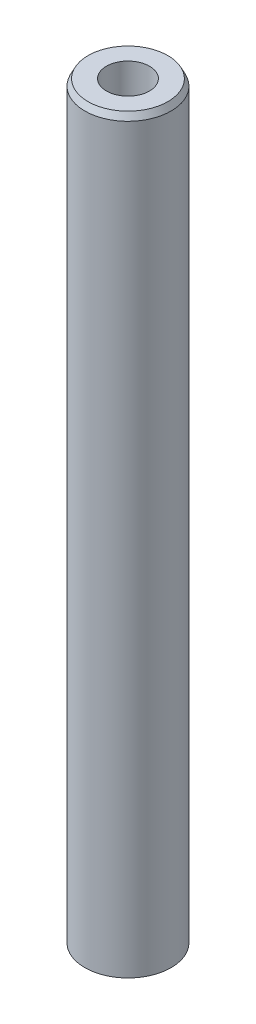
ISO-10303-21;
HEADER;
FILE_DESCRIPTION(('STEP AP214'),'2;1');
FILE_NAME('part.step','',(''),(''),'','','');
FILE_SCHEMA(('AUTOMOTIVE_DESIGN { 1 0 10303 214 1 1 1 1 }'));
ENDSEC;
DATA;
#1=APPLICATION_CONTEXT('core data for automotive mechanical design processes');
#2=APPLICATION_PROTOCOL_DEFINITION('international standard','automotive_design',2000,#1);
#3=PRODUCT_CONTEXT('',#1,'mechanical');
#4=PRODUCT('Part','Part','',(#3));
#5=PRODUCT_RELATED_PRODUCT_CATEGORY('part','',(#4));
#6=PRODUCT_DEFINITION_FORMATION('','',#4);
#7=PRODUCT_DEFINITION_CONTEXT('part definition',#1,'design');
#8=PRODUCT_DEFINITION('design','',#6,#7);
#9=PRODUCT_DEFINITION_SHAPE('','',#8);
#10=(LENGTH_UNIT() NAMED_UNIT(*) SI_UNIT(.MILLI.,.METRE.));
#11=(NAMED_UNIT(*) PLANE_ANGLE_UNIT() SI_UNIT($,.RADIAN.));
#12=(NAMED_UNIT(*) SI_UNIT($,.STERADIAN.) SOLID_ANGLE_UNIT());
#13=UNCERTAINTY_MEASURE_WITH_UNIT(LENGTH_MEASURE(1.E-05),#10,'distance_accuracy_value','');
#14=(GEOMETRIC_REPRESENTATION_CONTEXT(3) GLOBAL_UNCERTAINTY_ASSIGNED_CONTEXT((#13)) GLOBAL_UNIT_ASSIGNED_CONTEXT((#10,
#11,#12)) REPRESENTATION_CONTEXT('',''));
#15=CARTESIAN_POINT('',(0.,0.,0.));
#16=DIRECTION('',(0.,0.,1.));
#17=DIRECTION('',(1.,0.,0.));
#18=AXIS2_PLACEMENT_3D('',#15,#16,#17);
#19=CARTESIAN_POINT('',(0.,566.355812246667,0.));
#20=DIRECTION('',(0.,-1.,0.));
#21=DIRECTION('',(0.,0.,-1.));
#22=AXIS2_PLACEMENT_3D('',#19,#20,#21);
#23=CYLINDRICAL_SURFACE('',#22,32.5);
#24=CARTESIAN_POINT('',(0.,561.446967937793,0.));
#25=DIRECTION('',(0.,1.,0.));
#26=DIRECTION('',(0.,0.,1.));
#27=AXIS2_PLACEMENT_3D('',#24,#25,#26);
#28=CIRCLE('',#27,32.5);
#29=CARTESIAN_POINT('',(0.,561.446967937793,32.5));
#30=VERTEX_POINT('',#29);
#31=EDGE_CURVE('E50',#30,#30,#28,.F.);
#32=ORIENTED_EDGE('',*,*,#31,.T.);
#33=EDGE_LOOP('',(#32));
#34=FACE_BOUND('',#33,.T.);
#35=CARTESIAN_POINT('',(0.,2.41951669419316,0.));
#36=DIRECTION('',(0.,1.,0.));
#37=DIRECTION('',(0.,0.,1.));
#38=AXIS2_PLACEMENT_3D('',#35,#36,#37);
#39=CIRCLE('',#38,32.5);
#40=CARTESIAN_POINT('',(0.,2.41951669419316,32.5));
#41=VERTEX_POINT('',#40);
#42=EDGE_CURVE('E51',#41,#41,#39,.T.);
#43=ORIENTED_EDGE('',*,*,#42,.T.);
#44=EDGE_LOOP('',(#43));
#45=FACE_BOUND('',#44,.T.);
#46=ADVANCED_FACE('F39',(#34,#45),#23,.T.);
#47=CARTESIAN_POINT('',(0.,566.355812246667,0.));
#48=DIRECTION('',(0.,1.,0.));
#49=DIRECTION('',(0.,0.,1.));
#50=AXIS2_PLACEMENT_3D('',#47,#48,#49);
#51=PLANE('',#50);
#52=CARTESIAN_POINT('',(0.,566.355812246667,0.));
#53=DIRECTION('',(0.,1.,0.));
#54=DIRECTION('',(0.,0.,1.));
#55=AXIS2_PLACEMENT_3D('',#52,#53,#54);
#56=CIRCLE('',#55,30.0804833058067);
#57=CARTESIAN_POINT('',(0.,566.355812246667,30.0804833058067));
#58=VERTEX_POINT('',#57);
#59=EDGE_CURVE('E54',#58,#58,#56,.T.);
#60=ORIENTED_EDGE('',*,*,#59,.T.);
#61=EDGE_LOOP('',(#60));
#62=FACE_BOUND('',#61,.T.);
#63=CARTESIAN_POINT('',(0.,566.355812246667,0.));
#64=DIRECTION('',(0.,1.,0.));
#65=DIRECTION('',(0.,0.,1.));
#66=AXIS2_PLACEMENT_3D('',#63,#64,#65);
#67=CIRCLE('',#66,16.2275439347514);
#68=CARTESIAN_POINT('',(0.,566.355812246667,16.2275439347514));
#69=VERTEX_POINT('',#68);
#70=EDGE_CURVE('E58',#69,#69,#67,.T.);
#71=ORIENTED_EDGE('',*,*,#70,.F.);
#72=EDGE_LOOP('',(#71));
#73=FACE_BOUND('',#72,.T.);
#74=ADVANCED_FACE('F69',(#62,#73),#51,.T.);
#75=CARTESIAN_POINT('',(0.,0.,0.));
#76=DIRECTION('',(0.,1.,0.));
#77=DIRECTION('',(0.,0.,1.));
#78=AXIS2_PLACEMENT_3D('',#75,#76,#77);
#79=PLANE('',#78);
#80=CARTESIAN_POINT('',(0.,0.,0.));
#81=DIRECTION('',(0.,1.,0.));
#82=DIRECTION('',(0.,0.,1.));
#83=AXIS2_PLACEMENT_3D('',#80,#81,#82);
#84=CIRCLE('',#83,27.5911556911262);
#85=CARTESIAN_POINT('',(0.,0.,27.5911556911262));
#86=VERTEX_POINT('',#85);
#87=EDGE_CURVE('E10',#86,#86,#84,.F.);
#88=ORIENTED_EDGE('',*,*,#87,.T.);
#89=EDGE_LOOP('',(#88));
#90=FACE_BOUND('',#89,.T.);
#91=CARTESIAN_POINT('',(0.,0.,0.));
#92=DIRECTION('',(0.,1.,0.));
#93=DIRECTION('',(0.,0.,1.));
#94=AXIS2_PLACEMENT_3D('',#91,#92,#93);
#95=CIRCLE('',#94,16.2275439347514);
#96=CARTESIAN_POINT('',(0.,0.,16.2275439347514));
#97=VERTEX_POINT('',#96);
#98=EDGE_CURVE('E63',#97,#97,#95,.T.);
#99=ORIENTED_EDGE('',*,*,#98,.T.);
#100=EDGE_LOOP('',(#99));
#101=FACE_BOUND('',#100,.T.);
#102=ADVANCED_FACE('F75',(#90,#101),#79,.F.);
#103=CARTESIAN_POINT('',(0.,566.355812246667,0.));
#104=DIRECTION('',(0.,-1.,0.));
#105=DIRECTION('',(0.,0.,-1.));
#106=AXIS2_PLACEMENT_3D('',#103,#104,#105);
#107=CYLINDRICAL_SURFACE('',#106,16.2275439347514);
#108=ORIENTED_EDGE('',*,*,#70,.T.);
#109=EDGE_LOOP('',(#108));
#110=FACE_BOUND('',#109,.T.);
#111=ORIENTED_EDGE('',*,*,#98,.F.);
#112=EDGE_LOOP('',(#111));
#113=FACE_BOUND('',#112,.T.);
#114=ADVANCED_FACE('F70',(#110,#113),#107,.F.);
#115=CARTESIAN_POINT('',(0.,566.355812246667,0.));
#116=DIRECTION('',(0.,-1.,0.));
#117=DIRECTION('',(0.,0.,-1.));
#118=AXIS2_PLACEMENT_3D('',#115,#116,#117);
#119=CONICAL_SURFACE('',#118,30.0804833058067,0.457942861765304);
#120=ORIENTED_EDGE('',*,*,#31,.F.);
#121=EDGE_LOOP('',(#120));
#122=FACE_BOUND('',#121,.T.);
#123=ORIENTED_EDGE('',*,*,#59,.F.);
#124=EDGE_LOOP('',(#123));
#125=FACE_BOUND('',#124,.T.);
#126=ADVANCED_FACE('F81',(#122,#125),#119,.T.);
#127=CARTESIAN_POINT('',(0.,2.41951669419316,0.));
#128=DIRECTION('',(0.,1.,0.));
#129=DIRECTION('',(0.,0.,1.));
#130=AXIS2_PLACEMENT_3D('',#127,#128,#129);
#131=CONICAL_SURFACE('',#130,32.5,1.1128534650296);
#132=ORIENTED_EDGE('',*,*,#87,.F.);
#133=EDGE_LOOP('',(#132));
#134=FACE_BOUND('',#133,.T.);
#135=ORIENTED_EDGE('',*,*,#42,.F.);
#136=EDGE_LOOP('',(#135));
#137=FACE_BOUND('',#136,.T.);
#138=ADVANCED_FACE('F45',(#134,#137),#131,.T.);
#139=CLOSED_SHELL('',(#46,#74,#102,#114,#126,#138));
#140=MANIFOLD_SOLID_BREP('B2',#139);
#141=ADVANCED_BREP_SHAPE_REPRESENTATION('',(#18,#140),#14);
#142=SHAPE_DEFINITION_REPRESENTATION(#9,#141);
ENDSEC;
END-ISO-10303-21;
